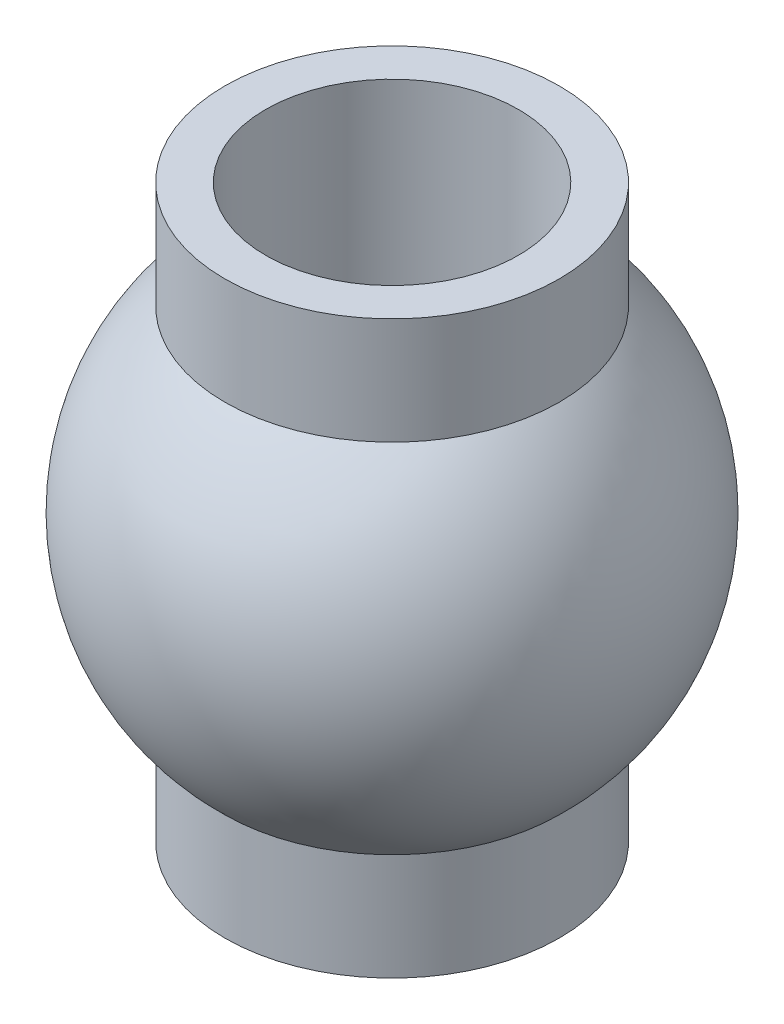
ISO-10303-21;
HEADER;
FILE_DESCRIPTION(('STEP AP214'),'2;1');
FILE_NAME('part.step','',(''),(''),'','','');
FILE_SCHEMA(('AUTOMOTIVE_DESIGN { 1 0 10303 214 1 1 1 1 }'));
ENDSEC;
DATA;
#1=APPLICATION_CONTEXT('core data for automotive mechanical design processes');
#2=APPLICATION_PROTOCOL_DEFINITION('international standard','automotive_design',2000,#1);
#3=PRODUCT_CONTEXT('',#1,'mechanical');
#4=PRODUCT('Part','Part','',(#3));
#5=PRODUCT_RELATED_PRODUCT_CATEGORY('part','',(#4));
#6=PRODUCT_DEFINITION_FORMATION('','',#4);
#7=PRODUCT_DEFINITION_CONTEXT('part definition',#1,'design');
#8=PRODUCT_DEFINITION('design','',#6,#7);
#9=PRODUCT_DEFINITION_SHAPE('','',#8);
#10=(LENGTH_UNIT() NAMED_UNIT(*) SI_UNIT(.MILLI.,.METRE.));
#11=(NAMED_UNIT(*) PLANE_ANGLE_UNIT() SI_UNIT($,.RADIAN.));
#12=(NAMED_UNIT(*) SI_UNIT($,.STERADIAN.) SOLID_ANGLE_UNIT());
#13=UNCERTAINTY_MEASURE_WITH_UNIT(LENGTH_MEASURE(1.E-05),#10,'distance_accuracy_value','');
#14=(GEOMETRIC_REPRESENTATION_CONTEXT(3) GLOBAL_UNCERTAINTY_ASSIGNED_CONTEXT((#13)) GLOBAL_UNIT_ASSIGNED_CONTEXT((#10,
#11,#12)) REPRESENTATION_CONTEXT('',''));
#15=CARTESIAN_POINT('',(0.,0.,0.));
#16=DIRECTION('',(0.,0.,1.));
#17=DIRECTION('',(1.,0.,0.));
#18=AXIS2_PLACEMENT_3D('',#15,#16,#17);
#19=CARTESIAN_POINT('',(0.,3.5,0.));
#20=DIRECTION('',(0.,1.,0.));
#21=DIRECTION('',(-1.,0.,0.));
#22=AXIS2_PLACEMENT_3D('',#19,#20,#21);
#23=CYLINDRICAL_SURFACE('',#22,2.05);
#24=CARTESIAN_POINT('',(0.,3.5,0.));
#25=DIRECTION('',(0.,1.,0.));
#26=DIRECTION('',(-1.,0.,0.));
#27=AXIS2_PLACEMENT_3D('',#24,#25,#26);
#28=CIRCLE('',#27,2.05);
#29=CARTESIAN_POINT('',(-2.05,3.5,0.));
#30=VERTEX_POINT('',#29);
#31=EDGE_CURVE('E10',#30,#30,#28,.T.);
#32=ORIENTED_EDGE('',*,*,#31,.F.);
#33=EDGE_LOOP('',(#32));
#34=FACE_BOUND('',#33,.T.);
#35=CARTESIAN_POINT('',(0.,2.19031961138095,0.));
#36=DIRECTION('',(0.,1.,0.));
#37=DIRECTION('',(-1.,0.,0.));
#38=AXIS2_PLACEMENT_3D('',#35,#36,#37);
#39=CIRCLE('',#38,2.05);
#40=CARTESIAN_POINT('',(-2.05,2.19031961138095,0.));
#41=VERTEX_POINT('',#40);
#42=EDGE_CURVE('E65',#41,#41,#39,.T.);
#43=ORIENTED_EDGE('',*,*,#42,.T.);
#44=EDGE_LOOP('',(#43));
#45=FACE_BOUND('',#44,.T.);
#46=ADVANCED_FACE('F38',(#34,#45),#23,.T.);
#47=CARTESIAN_POINT('',(1.55,3.5,0.));
#48=DIRECTION('',(0.,-1.,0.));
#49=DIRECTION('',(1.,0.,0.));
#50=AXIS2_PLACEMENT_3D('',#47,#48,#49);
#51=PLANE('',#50);
#52=CARTESIAN_POINT('',(0.,3.5,0.));
#53=DIRECTION('',(0.,1.,0.));
#54=DIRECTION('',(-1.,0.,0.));
#55=AXIS2_PLACEMENT_3D('',#52,#53,#54);
#56=CIRCLE('',#55,1.55);
#57=CARTESIAN_POINT('',(-1.55,3.5,0.));
#58=VERTEX_POINT('',#57);
#59=EDGE_CURVE('E45',#58,#58,#56,.T.);
#60=ORIENTED_EDGE('',*,*,#59,.F.);
#61=EDGE_LOOP('',(#60));
#62=FACE_BOUND('',#61,.T.);
#63=ORIENTED_EDGE('',*,*,#31,.T.);
#64=EDGE_LOOP('',(#63));
#65=FACE_BOUND('',#64,.T.);
#66=ADVANCED_FACE('F91',(#62,#65),#51,.F.);
#67=CARTESIAN_POINT('',(0.,3.5,0.));
#68=DIRECTION('',(0.,1.,0.));
#69=DIRECTION('',(-1.,0.,0.));
#70=AXIS2_PLACEMENT_3D('',#67,#68,#69);
#71=CYLINDRICAL_SURFACE('',#70,1.55);
#72=CARTESIAN_POINT('',(0.,-3.5,0.));
#73=DIRECTION('',(0.,1.,0.));
#74=DIRECTION('',(-1.,0.,0.));
#75=AXIS2_PLACEMENT_3D('',#72,#73,#74);
#76=CIRCLE('',#75,1.55);
#77=CARTESIAN_POINT('',(-1.55,-3.5,0.));
#78=VERTEX_POINT('',#77);
#79=EDGE_CURVE('E50',#78,#78,#76,.T.);
#80=ORIENTED_EDGE('',*,*,#79,.F.);
#81=EDGE_LOOP('',(#80));
#82=FACE_BOUND('',#81,.T.);
#83=ORIENTED_EDGE('',*,*,#59,.T.);
#84=EDGE_LOOP('',(#83));
#85=FACE_BOUND('',#84,.T.);
#86=ADVANCED_FACE('F86',(#82,#85),#71,.F.);
#87=CARTESIAN_POINT('',(1.55,-3.5,0.));
#88=DIRECTION('',(0.,1.,0.));
#89=DIRECTION('',(-1.,0.,0.));
#90=AXIS2_PLACEMENT_3D('',#87,#88,#89);
#91=PLANE('',#90);
#92=CARTESIAN_POINT('',(0.,-3.5,0.));
#93=DIRECTION('',(0.,1.,0.));
#94=DIRECTION('',(-1.,0.,0.));
#95=AXIS2_PLACEMENT_3D('',#92,#93,#94);
#96=CIRCLE('',#95,2.05);
#97=CARTESIAN_POINT('',(-2.05,-3.5,0.));
#98=VERTEX_POINT('',#97);
#99=EDGE_CURVE('E55',#98,#98,#96,.T.);
#100=ORIENTED_EDGE('',*,*,#99,.F.);
#101=EDGE_LOOP('',(#100));
#102=FACE_BOUND('',#101,.T.);
#103=ORIENTED_EDGE('',*,*,#79,.T.);
#104=EDGE_LOOP('',(#103));
#105=FACE_BOUND('',#104,.T.);
#106=ADVANCED_FACE('F80',(#102,#105),#91,.F.);
#107=CARTESIAN_POINT('',(0.,3.5,0.));
#108=DIRECTION('',(0.,1.,0.));
#109=DIRECTION('',(-1.,0.,0.));
#110=AXIS2_PLACEMENT_3D('',#107,#108,#109);
#111=CYLINDRICAL_SURFACE('',#110,2.05);
#112=CARTESIAN_POINT('',(0.,-2.19031961138095,0.));
#113=DIRECTION('',(0.,1.,0.));
#114=DIRECTION('',(-1.,0.,0.));
#115=AXIS2_PLACEMENT_3D('',#112,#113,#114);
#116=CIRCLE('',#115,2.05);
#117=CARTESIAN_POINT('',(-2.05,-2.19031961138095,0.));
#118=VERTEX_POINT('',#117);
#119=EDGE_CURVE('E61',#118,#118,#116,.T.);
#120=ORIENTED_EDGE('',*,*,#119,.F.);
#121=EDGE_LOOP('',(#120));
#122=FACE_BOUND('',#121,.T.);
#123=ORIENTED_EDGE('',*,*,#99,.T.);
#124=EDGE_LOOP('',(#123));
#125=FACE_BOUND('',#124,.T.);
#126=ADVANCED_FACE('F74',(#122,#125),#111,.T.);
#127=CARTESIAN_POINT('',(0.,0.,0.));
#128=DIRECTION('',(0.,1.,0.));
#129=DIRECTION('',(1.,0.,0.));
#130=AXIS2_PLACEMENT_3D('',#127,#128,#129);
#131=SPHERICAL_SURFACE('',#130,3.);
#132=ORIENTED_EDGE('',*,*,#42,.F.);
#133=EDGE_LOOP('',(#132));
#134=FACE_BOUND('',#133,.T.);
#135=ORIENTED_EDGE('',*,*,#119,.T.);
#136=EDGE_LOOP('',(#135));
#137=FACE_BOUND('',#136,.T.);
#138=ADVANCED_FACE('F71',(#134,#137),#131,.T.);
#139=CLOSED_SHELL('',(#46,#66,#86,#106,#126,#138));
#140=MANIFOLD_SOLID_BREP('B2',#139);
#141=ADVANCED_BREP_SHAPE_REPRESENTATION('',(#18,#140),#14);
#142=SHAPE_DEFINITION_REPRESENTATION(#9,#141);
ENDSEC;
END-ISO-10303-21;
